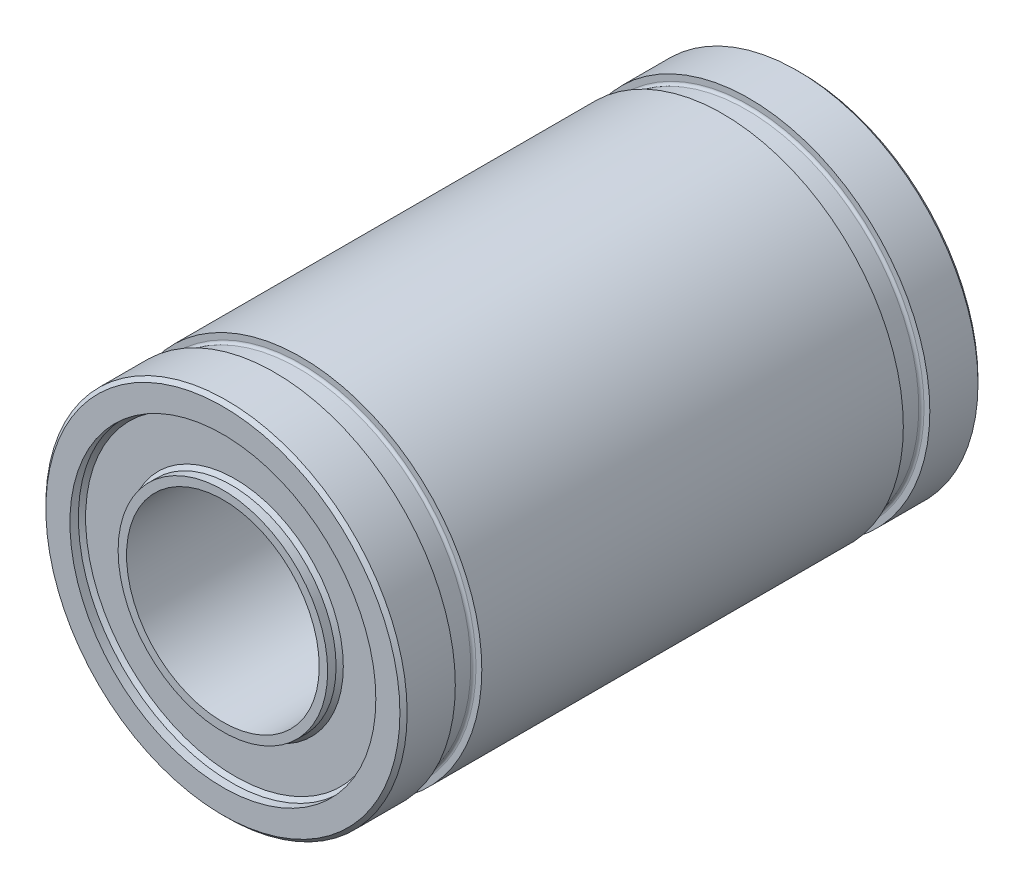
ISO-10303-21;
HEADER;
FILE_DESCRIPTION(('STEP AP214'),'2;1');
FILE_NAME('part.step','',(''),(''),'','','');
FILE_SCHEMA(('AUTOMOTIVE_DESIGN { 1 0 10303 214 1 1 1 1 }'));
ENDSEC;
DATA;
#1=APPLICATION_CONTEXT('core data for automotive mechanical design processes');
#2=APPLICATION_PROTOCOL_DEFINITION('international standard','automotive_design',2000,#1);
#3=PRODUCT_CONTEXT('',#1,'mechanical');
#4=PRODUCT('Part','Part','',(#3));
#5=PRODUCT_RELATED_PRODUCT_CATEGORY('part','',(#4));
#6=PRODUCT_DEFINITION_FORMATION('','',#4);
#7=PRODUCT_DEFINITION_CONTEXT('part definition',#1,'design');
#8=PRODUCT_DEFINITION('design','',#6,#7);
#9=PRODUCT_DEFINITION_SHAPE('','',#8);
#10=(LENGTH_UNIT() NAMED_UNIT(*) SI_UNIT(.MILLI.,.METRE.));
#11=(NAMED_UNIT(*) PLANE_ANGLE_UNIT() SI_UNIT($,.RADIAN.));
#12=(NAMED_UNIT(*) SI_UNIT($,.STERADIAN.) SOLID_ANGLE_UNIT());
#13=UNCERTAINTY_MEASURE_WITH_UNIT(LENGTH_MEASURE(1.E-05),#10,'distance_accuracy_value','');
#14=(GEOMETRIC_REPRESENTATION_CONTEXT(3) GLOBAL_UNCERTAINTY_ASSIGNED_CONTEXT((#13)) GLOBAL_UNIT_ASSIGNED_CONTEXT((#10,
#11,#12)) REPRESENTATION_CONTEXT('',''));
#15=CARTESIAN_POINT('',(0.,0.,0.));
#16=DIRECTION('',(0.,0.,1.));
#17=DIRECTION('',(1.,0.,0.));
#18=AXIS2_PLACEMENT_3D('',#15,#16,#17);
#19=CARTESIAN_POINT('',(0.,0.,-24.));
#20=DIRECTION('',(0.,0.,1.));
#21=DIRECTION('',(1.,0.,0.));
#22=AXIS2_PLACEMENT_3D('',#19,#20,#21);
#23=CYLINDRICAL_SURFACE('',#22,7.5);
#24=CARTESIAN_POINT('',(0.,0.,-23.85));
#25=DIRECTION('',(0.,0.,1.));
#26=DIRECTION('',(1.,0.,0.));
#27=AXIS2_PLACEMENT_3D('',#24,#25,#26);
#28=CIRCLE('',#27,7.5);
#29=CARTESIAN_POINT('',(7.5,0.,-23.85));
#30=VERTEX_POINT('',#29);
#31=EDGE_CURVE('E49',#30,#30,#28,.T.);
#32=ORIENTED_EDGE('',*,*,#31,.T.);
#33=EDGE_LOOP('',(#32));
#34=FACE_BOUND('',#33,.T.);
#35=CARTESIAN_POINT('',(0.,0.,-21.85));
#36=DIRECTION('',(0.,0.,1.));
#37=DIRECTION('',(1.,0.,0.));
#38=AXIS2_PLACEMENT_3D('',#35,#36,#37);
#39=CIRCLE('',#38,7.5);
#40=CARTESIAN_POINT('',(7.5,0.,-21.85));
#41=VERTEX_POINT('',#40);
#42=EDGE_CURVE('E114',#41,#41,#39,.T.);
#43=ORIENTED_EDGE('',*,*,#42,.F.);
#44=EDGE_LOOP('',(#43));
#45=FACE_BOUND('',#44,.T.);
#46=ADVANCED_FACE('F34',(#34,#45),#23,.T.);
#47=CARTESIAN_POINT('',(0.,0.,-3.25));
#48=DIRECTION('',(0.,0.,1.));
#49=DIRECTION('',(1.,0.,0.));
#50=AXIS2_PLACEMENT_3D('',#47,#48,#49);
#51=CIRCLE('',#50,7.5);
#52=CARTESIAN_POINT('',(7.49999999999999,0.,-3.25));
#53=VERTEX_POINT('',#52);
#54=EDGE_CURVE('E96',#53,#53,#51,.T.);
#55=ORIENTED_EDGE('',*,*,#54,.F.);
#56=EDGE_LOOP('',(#55));
#57=FACE_BOUND('',#56,.T.);
#58=CARTESIAN_POINT('',(0.,0.,-20.75));
#59=DIRECTION('',(0.,0.,1.));
#60=DIRECTION('',(1.,0.,0.));
#61=AXIS2_PLACEMENT_3D('',#58,#59,#60);
#62=CIRCLE('',#61,7.5);
#63=CARTESIAN_POINT('',(7.5,0.,-20.75));
#64=VERTEX_POINT('',#63);
#65=EDGE_CURVE('E129',#64,#64,#62,.T.);
#66=ORIENTED_EDGE('',*,*,#65,.T.);
#67=EDGE_LOOP('',(#66));
#68=FACE_BOUND('',#67,.T.);
#69=ADVANCED_FACE('F133',(#57,#68),#23,.T.);
#70=CARTESIAN_POINT('',(0.,0.,-0.150000000000001));
#71=DIRECTION('',(0.,0.,1.));
#72=DIRECTION('',(1.,0.,0.));
#73=AXIS2_PLACEMENT_3D('',#70,#71,#72);
#74=CIRCLE('',#73,7.5);
#75=CARTESIAN_POINT('',(7.5,0.,-0.150000000000001));
#76=VERTEX_POINT('',#75);
#77=EDGE_CURVE('E10',#76,#76,#74,.F.);
#78=ORIENTED_EDGE('',*,*,#77,.T.);
#79=EDGE_LOOP('',(#78));
#80=FACE_BOUND('',#79,.T.);
#81=CARTESIAN_POINT('',(0.,0.,-2.15000000000001));
#82=DIRECTION('',(0.,0.,1.));
#83=DIRECTION('',(1.,0.,0.));
#84=AXIS2_PLACEMENT_3D('',#81,#82,#83);
#85=CIRCLE('',#84,7.5);
#86=CARTESIAN_POINT('',(7.49999999999999,0.,-2.15000000000001));
#87=VERTEX_POINT('',#86);
#88=EDGE_CURVE('E111',#87,#87,#85,.T.);
#89=ORIENTED_EDGE('',*,*,#88,.T.);
#90=EDGE_LOOP('',(#89));
#91=FACE_BOUND('',#90,.T.);
#92=ADVANCED_FACE('F154',(#80,#91),#23,.T.);
#93=CARTESIAN_POINT('',(0.,0.,-24.));
#94=DIRECTION('',(0.,0.,1.));
#95=DIRECTION('',(1.,0.,0.));
#96=AXIS2_PLACEMENT_3D('',#93,#94,#95);
#97=PLANE('',#96);
#98=CARTESIAN_POINT('',(0.,0.,-24.));
#99=DIRECTION('',(0.,0.,1.));
#100=DIRECTION('',(1.,0.,0.));
#101=AXIS2_PLACEMENT_3D('',#98,#99,#100);
#102=CIRCLE('',#101,4.);
#103=CARTESIAN_POINT('',(4.,0.,-24.));
#104=VERTEX_POINT('',#103);
#105=EDGE_CURVE('E78',#104,#104,#102,.T.);
#106=ORIENTED_EDGE('',*,*,#105,.T.);
#107=EDGE_LOOP('',(#106));
#108=FACE_BOUND('',#107,.T.);
#109=CARTESIAN_POINT('',(0.,0.,-24.));
#110=DIRECTION('',(0.,0.,-1.));
#111=DIRECTION('',(-1.,0.,0.));
#112=AXIS2_PLACEMENT_3D('',#109,#110,#111);
#113=CIRCLE('',#112,4.35);
#114=CARTESIAN_POINT('',(-4.35,0.,-24.));
#115=VERTEX_POINT('',#114);
#116=EDGE_CURVE('E93',#115,#115,#113,.T.);
#117=ORIENTED_EDGE('',*,*,#116,.T.);
#118=EDGE_LOOP('',(#117));
#119=FACE_BOUND('',#118,.T.);
#120=ADVANCED_FACE('F162',(#108,#119),#97,.F.);
#121=CARTESIAN_POINT('',(0.,0.,0.));
#122=DIRECTION('',(0.,0.,1.));
#123=DIRECTION('',(1.,0.,0.));
#124=AXIS2_PLACEMENT_3D('',#121,#122,#123);
#125=PLANE('',#124);
#126=CARTESIAN_POINT('',(0.,0.,0.));
#127=DIRECTION('',(0.,0.,1.));
#128=DIRECTION('',(1.,0.,0.));
#129=AXIS2_PLACEMENT_3D('',#126,#127,#128);
#130=CIRCLE('',#129,4.);
#131=CARTESIAN_POINT('',(4.,0.,0.));
#132=VERTEX_POINT('',#131);
#133=EDGE_CURVE('E79',#132,#132,#130,.T.);
#134=ORIENTED_EDGE('',*,*,#133,.F.);
#135=EDGE_LOOP('',(#134));
#136=FACE_BOUND('',#135,.T.);
#137=CARTESIAN_POINT('',(0.,0.,0.));
#138=DIRECTION('',(0.,0.,1.));
#139=DIRECTION('',(1.,0.,0.));
#140=AXIS2_PLACEMENT_3D('',#137,#138,#139);
#141=CIRCLE('',#140,4.35);
#142=CARTESIAN_POINT('',(4.35,0.,0.));
#143=VERTEX_POINT('',#142);
#144=EDGE_CURVE('E87',#143,#143,#141,.T.);
#145=ORIENTED_EDGE('',*,*,#144,.T.);
#146=EDGE_LOOP('',(#145));
#147=FACE_BOUND('',#146,.T.);
#148=ADVANCED_FACE('F166',(#136,#147),#125,.T.);
#149=CARTESIAN_POINT('',(0.,0.,-24.));
#150=DIRECTION('',(0.,0.,1.));
#151=DIRECTION('',(1.,0.,0.));
#152=AXIS2_PLACEMENT_3D('',#149,#150,#151);
#153=CIRCLE('',#152,7.34999999999999);
#154=CARTESIAN_POINT('',(7.34999999999999,0.,-24.));
#155=VERTEX_POINT('',#154);
#156=EDGE_CURVE('E45',#155,#155,#153,.F.);
#157=ORIENTED_EDGE('',*,*,#156,.T.);
#158=EDGE_LOOP('',(#157));
#159=FACE_BOUND('',#158,.T.);
#160=CARTESIAN_POINT('',(0.,0.,-24.));
#161=DIRECTION('',(0.,0.,-1.));
#162=DIRECTION('',(-1.,0.,0.));
#163=AXIS2_PLACEMENT_3D('',#160,#161,#162);
#164=CIRCLE('',#163,6.35);
#165=CARTESIAN_POINT('',(-6.35,0.,-24.));
#166=VERTEX_POINT('',#165);
#167=EDGE_CURVE('E90',#166,#166,#164,.T.);
#168=ORIENTED_EDGE('',*,*,#167,.F.);
#169=EDGE_LOOP('',(#168));
#170=FACE_BOUND('',#169,.T.);
#171=ADVANCED_FACE('F169',(#159,#170),#97,.F.);
#172=CARTESIAN_POINT('',(0.,0.,0.));
#173=DIRECTION('',(0.,0.,1.));
#174=DIRECTION('',(1.,0.,0.));
#175=AXIS2_PLACEMENT_3D('',#172,#173,#174);
#176=CIRCLE('',#175,7.35);
#177=CARTESIAN_POINT('',(7.35,0.,0.));
#178=VERTEX_POINT('',#177);
#179=EDGE_CURVE('E41',#178,#178,#176,.T.);
#180=ORIENTED_EDGE('',*,*,#179,.T.);
#181=EDGE_LOOP('',(#180));
#182=FACE_BOUND('',#181,.T.);
#183=CARTESIAN_POINT('',(0.,0.,0.));
#184=DIRECTION('',(0.,0.,1.));
#185=DIRECTION('',(1.,0.,0.));
#186=AXIS2_PLACEMENT_3D('',#183,#184,#185);
#187=CIRCLE('',#186,6.35);
#188=CARTESIAN_POINT('',(6.35,0.,0.));
#189=VERTEX_POINT('',#188);
#190=EDGE_CURVE('E82',#189,#189,#187,.T.);
#191=ORIENTED_EDGE('',*,*,#190,.F.);
#192=EDGE_LOOP('',(#191));
#193=FACE_BOUND('',#192,.T.);
#194=ADVANCED_FACE('F228',(#182,#193),#125,.T.);
#195=CARTESIAN_POINT('',(0.,0.,-24.));
#196=DIRECTION('',(0.,0.,1.));
#197=DIRECTION('',(1.,0.,0.));
#198=AXIS2_PLACEMENT_3D('',#195,#196,#197);
#199=CYLINDRICAL_SURFACE('',#198,4.);
#200=ORIENTED_EDGE('',*,*,#105,.F.);
#201=EDGE_LOOP('',(#200));
#202=FACE_BOUND('',#201,.T.);
#203=ORIENTED_EDGE('',*,*,#133,.T.);
#204=EDGE_LOOP('',(#203));
#205=FACE_BOUND('',#204,.T.);
#206=ADVANCED_FACE('F225',(#202,#205),#199,.F.);
#207=CARTESIAN_POINT('',(0.,0.,-0.5));
#208=DIRECTION('',(0.,0.,1.));
#209=DIRECTION('',(1.,0.,0.));
#210=AXIS2_PLACEMENT_3D('',#207,#208,#209);
#211=CYLINDRICAL_SURFACE('',#210,6.35);
#212=CARTESIAN_POINT('',(0.,0.,-0.350000000000004));
#213=DIRECTION('',(0.,0.,1.));
#214=DIRECTION('',(1.,0.,0.));
#215=AXIS2_PLACEMENT_3D('',#212,#213,#214);
#216=CIRCLE('',#215,6.35);
#217=CARTESIAN_POINT('',(6.35,0.,-0.350000000000004));
#218=VERTEX_POINT('',#217);
#219=EDGE_CURVE('E57',#218,#218,#216,.F.);
#220=ORIENTED_EDGE('',*,*,#219,.T.);
#221=EDGE_LOOP('',(#220));
#222=FACE_BOUND('',#221,.T.);
#223=ORIENTED_EDGE('',*,*,#190,.T.);
#224=EDGE_LOOP('',(#223));
#225=FACE_BOUND('',#224,.T.);
#226=ADVANCED_FACE('F221',(#222,#225),#211,.F.);
#227=CARTESIAN_POINT('',(0.,0.,-0.5));
#228=DIRECTION('',(0.,0.,1.));
#229=DIRECTION('',(1.,0.,0.));
#230=AXIS2_PLACEMENT_3D('',#227,#228,#229);
#231=PLANE('',#230);
#232=CARTESIAN_POINT('',(0.,0.,-0.5));
#233=DIRECTION('',(0.,0.,1.));
#234=DIRECTION('',(1.,0.,0.));
#235=AXIS2_PLACEMENT_3D('',#232,#233,#234);
#236=CIRCLE('',#235,6.2);
#237=CARTESIAN_POINT('',(6.2,0.,-0.5));
#238=VERTEX_POINT('',#237);
#239=EDGE_CURVE('E60',#238,#238,#236,.T.);
#240=ORIENTED_EDGE('',*,*,#239,.T.);
#241=EDGE_LOOP('',(#240));
#242=FACE_BOUND('',#241,.T.);
#243=CARTESIAN_POINT('',(0.,0.,-0.5));
#244=DIRECTION('',(0.,0.,1.));
#245=DIRECTION('',(1.,0.,0.));
#246=AXIS2_PLACEMENT_3D('',#243,#244,#245);
#247=CIRCLE('',#246,4.5);
#248=CARTESIAN_POINT('',(4.5,0.,-0.5));
#249=VERTEX_POINT('',#248);
#250=EDGE_CURVE('E63',#249,#249,#247,.F.);
#251=ORIENTED_EDGE('',*,*,#250,.T.);
#252=EDGE_LOOP('',(#251));
#253=FACE_BOUND('',#252,.T.);
#254=ADVANCED_FACE('F217',(#242,#253),#231,.T.);
#255=CARTESIAN_POINT('',(0.,0.,-0.5));
#256=DIRECTION('',(0.,0.,1.));
#257=DIRECTION('',(1.,0.,0.));
#258=AXIS2_PLACEMENT_3D('',#255,#256,#257);
#259=CYLINDRICAL_SURFACE('',#258,4.35);
#260=CARTESIAN_POINT('',(0.,0.,-0.349999999999997));
#261=DIRECTION('',(0.,0.,1.));
#262=DIRECTION('',(1.,0.,0.));
#263=AXIS2_PLACEMENT_3D('',#260,#261,#262);
#264=CIRCLE('',#263,4.35);
#265=CARTESIAN_POINT('',(4.35,0.,-0.349999999999997));
#266=VERTEX_POINT('',#265);
#267=EDGE_CURVE('E54',#266,#266,#264,.T.);
#268=ORIENTED_EDGE('',*,*,#267,.T.);
#269=EDGE_LOOP('',(#268));
#270=FACE_BOUND('',#269,.T.);
#271=ORIENTED_EDGE('',*,*,#144,.F.);
#272=EDGE_LOOP('',(#271));
#273=FACE_BOUND('',#272,.T.);
#274=ADVANCED_FACE('F213',(#270,#273),#259,.T.);
#275=CARTESIAN_POINT('',(0.,0.,-23.5));
#276=DIRECTION('',(0.,0.,-1.));
#277=DIRECTION('',(-1.,0.,0.));
#278=AXIS2_PLACEMENT_3D('',#275,#276,#277);
#279=CYLINDRICAL_SURFACE('',#278,6.35);
#280=CARTESIAN_POINT('',(0.,0.,-23.65));
#281=DIRECTION('',(0.,0.,-1.));
#282=DIRECTION('',(-1.,0.,0.));
#283=AXIS2_PLACEMENT_3D('',#280,#281,#282);
#284=CIRCLE('',#283,6.35);
#285=CARTESIAN_POINT('',(-6.35,0.,-23.65));
#286=VERTEX_POINT('',#285);
#287=EDGE_CURVE('E69',#286,#286,#284,.F.);
#288=ORIENTED_EDGE('',*,*,#287,.T.);
#289=EDGE_LOOP('',(#288));
#290=FACE_BOUND('',#289,.T.);
#291=ORIENTED_EDGE('',*,*,#167,.T.);
#292=EDGE_LOOP('',(#291));
#293=FACE_BOUND('',#292,.T.);
#294=ADVANCED_FACE('F209',(#290,#293),#279,.F.);
#295=CARTESIAN_POINT('',(0.,0.,-23.5));
#296=DIRECTION('',(0.,0.,-1.));
#297=DIRECTION('',(-1.,0.,0.));
#298=AXIS2_PLACEMENT_3D('',#295,#296,#297);
#299=PLANE('',#298);
#300=CARTESIAN_POINT('',(0.,0.,-23.5));
#301=DIRECTION('',(0.,0.,-1.));
#302=DIRECTION('',(-1.,0.,0.));
#303=AXIS2_PLACEMENT_3D('',#300,#301,#302);
#304=CIRCLE('',#303,6.2);
#305=CARTESIAN_POINT('',(-6.2,0.,-23.5));
#306=VERTEX_POINT('',#305);
#307=EDGE_CURVE('E72',#306,#306,#304,.T.);
#308=ORIENTED_EDGE('',*,*,#307,.T.);
#309=EDGE_LOOP('',(#308));
#310=FACE_BOUND('',#309,.T.);
#311=CARTESIAN_POINT('',(0.,0.,-23.5));
#312=DIRECTION('',(0.,0.,-1.));
#313=DIRECTION('',(-1.,0.,0.));
#314=AXIS2_PLACEMENT_3D('',#311,#312,#313);
#315=CIRCLE('',#314,4.5);
#316=CARTESIAN_POINT('',(-4.5,0.,-23.5));
#317=VERTEX_POINT('',#316);
#318=EDGE_CURVE('E75',#317,#317,#315,.F.);
#319=ORIENTED_EDGE('',*,*,#318,.T.);
#320=EDGE_LOOP('',(#319));
#321=FACE_BOUND('',#320,.T.);
#322=ADVANCED_FACE('F205',(#310,#321),#299,.T.);
#323=CARTESIAN_POINT('',(0.,0.,-23.5));
#324=DIRECTION('',(0.,0.,-1.));
#325=DIRECTION('',(-1.,0.,0.));
#326=AXIS2_PLACEMENT_3D('',#323,#324,#325);
#327=CYLINDRICAL_SURFACE('',#326,4.35);
#328=CARTESIAN_POINT('',(0.,0.,-23.65));
#329=DIRECTION('',(0.,0.,-1.));
#330=DIRECTION('',(-1.,0.,0.));
#331=AXIS2_PLACEMENT_3D('',#328,#329,#330);
#332=CIRCLE('',#331,4.35);
#333=CARTESIAN_POINT('',(-4.35,0.,-23.65));
#334=VERTEX_POINT('',#333);
#335=EDGE_CURVE('E66',#334,#334,#332,.T.);
#336=ORIENTED_EDGE('',*,*,#335,.T.);
#337=EDGE_LOOP('',(#336));
#338=FACE_BOUND('',#337,.T.);
#339=ORIENTED_EDGE('',*,*,#116,.F.);
#340=EDGE_LOOP('',(#339));
#341=FACE_BOUND('',#340,.T.);
#342=ADVANCED_FACE('F201',(#338,#341),#327,.T.);
#343=CARTESIAN_POINT('',(-6.97821124051748,-2.00303966079445,-3.25));
#344=DIRECTION('',(0.,0.,1.));
#345=DIRECTION('',(1.,0.,0.));
#346=AXIS2_PLACEMENT_3D('',#343,#344,#345);
#347=PLANE('',#346);
#348=ORIENTED_EDGE('',*,*,#54,.T.);
#349=EDGE_LOOP('',(#348));
#350=FACE_BOUND('',#349,.T.);
#351=CARTESIAN_POINT('',(0.,0.,-3.25));
#352=DIRECTION('',(0.,0.,1.));
#353=DIRECTION('',(1.,0.,0.));
#354=AXIS2_PLACEMENT_3D('',#351,#352,#353);
#355=CIRCLE('',#354,7.26);
#356=CARTESIAN_POINT('',(7.26,0.,-3.25));
#357=VERTEX_POINT('',#356);
#358=EDGE_CURVE('E99',#357,#357,#355,.T.);
#359=ORIENTED_EDGE('',*,*,#358,.F.);
#360=EDGE_LOOP('',(#359));
#361=FACE_BOUND('',#360,.T.);
#362=ADVANCED_FACE('F197',(#350,#361),#347,.T.);
#363=CARTESIAN_POINT('',(0.,0.,-3.14));
#364=DIRECTION('',(0.,0.,1.));
#365=DIRECTION('',(1.,0.,0.));
#366=AXIS2_PLACEMENT_3D('',#363,#364,#365);
#367=TOROIDAL_SURFACE('',#366,7.26,0.110000000000001);
#368=ORIENTED_EDGE('',*,*,#358,.T.);
#369=EDGE_LOOP('',(#368));
#370=FACE_BOUND('',#369,.T.);
#371=CARTESIAN_POINT('',(0.,0.,-3.14000000000001));
#372=DIRECTION('',(0.,0.,1.));
#373=DIRECTION('',(1.,0.,0.));
#374=AXIS2_PLACEMENT_3D('',#371,#372,#373);
#375=CIRCLE('',#374,7.15);
#376=CARTESIAN_POINT('',(7.15,0.,-3.14000000000001));
#377=VERTEX_POINT('',#376);
#378=EDGE_CURVE('E102',#377,#377,#375,.T.);
#379=ORIENTED_EDGE('',*,*,#378,.F.);
#380=EDGE_LOOP('',(#379));
#381=FACE_BOUND('',#380,.T.);
#382=ADVANCED_FACE('F193',(#370,#381),#367,.F.);
#383=CARTESIAN_POINT('',(0.,0.,-38.0258731229228));
#384=DIRECTION('',(0.,0.,1.));
#385=DIRECTION('',(1.,0.,0.));
#386=AXIS2_PLACEMENT_3D('',#383,#384,#385);
#387=CYLINDRICAL_SURFACE('',#386,7.15);
#388=ORIENTED_EDGE('',*,*,#378,.T.);
#389=EDGE_LOOP('',(#388));
#390=FACE_BOUND('',#389,.T.);
#391=CARTESIAN_POINT('',(0.,0.,-2.26000000000001));
#392=DIRECTION('',(0.,0.,1.));
#393=DIRECTION('',(1.,0.,0.));
#394=AXIS2_PLACEMENT_3D('',#391,#392,#393);
#395=CIRCLE('',#394,7.15);
#396=CARTESIAN_POINT('',(7.15,0.,-2.26));
#397=VERTEX_POINT('',#396);
#398=EDGE_CURVE('E105',#397,#397,#395,.T.);
#399=ORIENTED_EDGE('',*,*,#398,.F.);
#400=EDGE_LOOP('',(#399));
#401=FACE_BOUND('',#400,.T.);
#402=ADVANCED_FACE('F186',(#390,#401),#387,.T.);
#403=CARTESIAN_POINT('',(0.,0.,-2.26000000000001));
#404=DIRECTION('',(0.,0.,1.));
#405=DIRECTION('',(1.,0.,0.));
#406=AXIS2_PLACEMENT_3D('',#403,#404,#405);
#407=TOROIDAL_SURFACE('',#406,7.26,0.109999999999998);
#408=ORIENTED_EDGE('',*,*,#398,.T.);
#409=EDGE_LOOP('',(#408));
#410=FACE_BOUND('',#409,.T.);
#411=CARTESIAN_POINT('',(0.,0.,-2.15000000000001));
#412=DIRECTION('',(0.,0.,1.));
#413=DIRECTION('',(1.,0.,0.));
#414=AXIS2_PLACEMENT_3D('',#411,#412,#413);
#415=CIRCLE('',#414,7.26);
#416=CARTESIAN_POINT('',(7.26,0.,-2.15000000000001));
#417=VERTEX_POINT('',#416);
#418=EDGE_CURVE('E108',#417,#417,#415,.T.);
#419=ORIENTED_EDGE('',*,*,#418,.F.);
#420=EDGE_LOOP('',(#419));
#421=FACE_BOUND('',#420,.T.);
#422=ADVANCED_FACE('F176',(#410,#421),#407,.F.);
#423=CARTESIAN_POINT('',(-7.20889590962549,-2.06925584792816,-2.15000000000001));
#424=DIRECTION('',(0.,0.,-1.));
#425=DIRECTION('',(-1.,0.,0.));
#426=AXIS2_PLACEMENT_3D('',#423,#424,#425);
#427=PLANE('',#426);
#428=ORIENTED_EDGE('',*,*,#418,.T.);
#429=EDGE_LOOP('',(#428));
#430=FACE_BOUND('',#429,.T.);
#431=ORIENTED_EDGE('',*,*,#88,.F.);
#432=EDGE_LOOP('',(#431));
#433=FACE_BOUND('',#432,.T.);
#434=ADVANCED_FACE('F173',(#430,#433),#427,.T.);
#435=CARTESIAN_POINT('',(-6.97821124051748,-2.00303966079445,-21.85));
#436=DIRECTION('',(0.,0.,1.));
#437=DIRECTION('',(1.,0.,0.));
#438=AXIS2_PLACEMENT_3D('',#435,#436,#437);
#439=PLANE('',#438);
#440=ORIENTED_EDGE('',*,*,#42,.T.);
#441=EDGE_LOOP('',(#440));
#442=FACE_BOUND('',#441,.T.);
#443=CARTESIAN_POINT('',(0.,0.,-21.85));
#444=DIRECTION('',(0.,0.,1.));
#445=DIRECTION('',(1.,0.,0.));
#446=AXIS2_PLACEMENT_3D('',#443,#444,#445);
#447=CIRCLE('',#446,7.26);
#448=CARTESIAN_POINT('',(7.26,0.,-21.85));
#449=VERTEX_POINT('',#448);
#450=EDGE_CURVE('E117',#449,#449,#447,.T.);
#451=ORIENTED_EDGE('',*,*,#450,.F.);
#452=EDGE_LOOP('',(#451));
#453=FACE_BOUND('',#452,.T.);
#454=ADVANCED_FACE('F175',(#442,#453),#439,.T.);
#455=CARTESIAN_POINT('',(0.,0.,-21.74));
#456=DIRECTION('',(0.,0.,1.));
#457=DIRECTION('',(1.,0.,0.));
#458=AXIS2_PLACEMENT_3D('',#455,#456,#457);
#459=TOROIDAL_SURFACE('',#458,7.26,0.110000000000001);
#460=ORIENTED_EDGE('',*,*,#450,.T.);
#461=EDGE_LOOP('',(#460));
#462=FACE_BOUND('',#461,.T.);
#463=CARTESIAN_POINT('',(0.,0.,-21.74));
#464=DIRECTION('',(0.,0.,1.));
#465=DIRECTION('',(1.,0.,0.));
#466=AXIS2_PLACEMENT_3D('',#463,#464,#465);
#467=CIRCLE('',#466,7.15);
#468=CARTESIAN_POINT('',(7.15,0.,-21.74));
#469=VERTEX_POINT('',#468);
#470=EDGE_CURVE('E120',#469,#469,#467,.T.);
#471=ORIENTED_EDGE('',*,*,#470,.F.);
#472=EDGE_LOOP('',(#471));
#473=FACE_BOUND('',#472,.T.);
#474=ADVANCED_FACE('F183',(#462,#473),#459,.F.);
#475=CARTESIAN_POINT('',(0.,0.,-38.0258731229228));
#476=DIRECTION('',(0.,0.,1.));
#477=DIRECTION('',(1.,0.,0.));
#478=AXIS2_PLACEMENT_3D('',#475,#476,#477);
#479=CYLINDRICAL_SURFACE('',#478,7.15);
#480=ORIENTED_EDGE('',*,*,#470,.T.);
#481=EDGE_LOOP('',(#480));
#482=FACE_BOUND('',#481,.T.);
#483=CARTESIAN_POINT('',(0.,0.,-20.86));
#484=DIRECTION('',(0.,0.,1.));
#485=DIRECTION('',(1.,0.,0.));
#486=AXIS2_PLACEMENT_3D('',#483,#484,#485);
#487=CIRCLE('',#486,7.15);
#488=CARTESIAN_POINT('',(7.15,0.,-20.86));
#489=VERTEX_POINT('',#488);
#490=EDGE_CURVE('E123',#489,#489,#487,.T.);
#491=ORIENTED_EDGE('',*,*,#490,.F.);
#492=EDGE_LOOP('',(#491));
#493=FACE_BOUND('',#492,.T.);
#494=ADVANCED_FACE('F148',(#482,#493),#479,.T.);
#495=CARTESIAN_POINT('',(0.,0.,-20.86));
#496=DIRECTION('',(0.,0.,1.));
#497=DIRECTION('',(1.,0.,0.));
#498=AXIS2_PLACEMENT_3D('',#495,#496,#497);
#499=TOROIDAL_SURFACE('',#498,7.26,0.109999999999999);
#500=ORIENTED_EDGE('',*,*,#490,.T.);
#501=EDGE_LOOP('',(#500));
#502=FACE_BOUND('',#501,.T.);
#503=CARTESIAN_POINT('',(0.,0.,-20.75));
#504=DIRECTION('',(0.,0.,1.));
#505=DIRECTION('',(1.,0.,0.));
#506=AXIS2_PLACEMENT_3D('',#503,#504,#505);
#507=CIRCLE('',#506,7.26);
#508=CARTESIAN_POINT('',(7.26,0.,-20.75));
#509=VERTEX_POINT('',#508);
#510=EDGE_CURVE('E126',#509,#509,#507,.T.);
#511=ORIENTED_EDGE('',*,*,#510,.F.);
#512=EDGE_LOOP('',(#511));
#513=FACE_BOUND('',#512,.T.);
#514=ADVANCED_FACE('F138',(#502,#513),#499,.F.);
#515=CARTESIAN_POINT('',(-7.20889590962549,-2.06925584792816,-20.75));
#516=DIRECTION('',(0.,0.,-1.));
#517=DIRECTION('',(-1.,0.,0.));
#518=AXIS2_PLACEMENT_3D('',#515,#516,#517);
#519=PLANE('',#518);
#520=ORIENTED_EDGE('',*,*,#510,.T.);
#521=EDGE_LOOP('',(#520));
#522=FACE_BOUND('',#521,.T.);
#523=ORIENTED_EDGE('',*,*,#65,.F.);
#524=EDGE_LOOP('',(#523));
#525=FACE_BOUND('',#524,.T.);
#526=ADVANCED_FACE('F135',(#522,#525),#519,.T.);
#527=CARTESIAN_POINT('',(0.,0.,-23.5));
#528=DIRECTION('',(0.,0.,-1.));
#529=DIRECTION('',(-1.,0.,0.));
#530=AXIS2_PLACEMENT_3D('',#527,#528,#529);
#531=CONICAL_SURFACE('',#530,6.2,0.785398163397451);
#532=ORIENTED_EDGE('',*,*,#287,.F.);
#533=EDGE_LOOP('',(#532));
#534=FACE_BOUND('',#533,.T.);
#535=ORIENTED_EDGE('',*,*,#307,.F.);
#536=EDGE_LOOP('',(#535));
#537=FACE_BOUND('',#536,.T.);
#538=ADVANCED_FACE('F137',(#534,#537),#531,.F.);
#539=CARTESIAN_POINT('',(0.,0.,-23.65));
#540=DIRECTION('',(0.,0.,1.));
#541=DIRECTION('',(1.,0.,0.));
#542=AXIS2_PLACEMENT_3D('',#539,#540,#541);
#543=CONICAL_SURFACE('',#542,4.35,0.785398163397448);
#544=ORIENTED_EDGE('',*,*,#318,.F.);
#545=EDGE_LOOP('',(#544));
#546=FACE_BOUND('',#545,.T.);
#547=ORIENTED_EDGE('',*,*,#335,.F.);
#548=EDGE_LOOP('',(#547));
#549=FACE_BOUND('',#548,.T.);
#550=ADVANCED_FACE('F145',(#546,#549),#543,.T.);
#551=CARTESIAN_POINT('',(0.,0.,-0.5));
#552=DIRECTION('',(0.,0.,1.));
#553=DIRECTION('',(1.,0.,0.));
#554=AXIS2_PLACEMENT_3D('',#551,#552,#553);
#555=CONICAL_SURFACE('',#554,6.2,0.785398163397454);
#556=ORIENTED_EDGE('',*,*,#219,.F.);
#557=EDGE_LOOP('',(#556));
#558=FACE_BOUND('',#557,.T.);
#559=ORIENTED_EDGE('',*,*,#239,.F.);
#560=EDGE_LOOP('',(#559));
#561=FACE_BOUND('',#560,.T.);
#562=ADVANCED_FACE('F312',(#558,#561),#555,.F.);
#563=CARTESIAN_POINT('',(0.,0.,-0.349999999999997));
#564=DIRECTION('',(0.,0.,-1.));
#565=DIRECTION('',(-1.,0.,0.));
#566=AXIS2_PLACEMENT_3D('',#563,#564,#565);
#567=CONICAL_SURFACE('',#566,4.35,0.78539816339744);
#568=ORIENTED_EDGE('',*,*,#250,.F.);
#569=EDGE_LOOP('',(#568));
#570=FACE_BOUND('',#569,.T.);
#571=ORIENTED_EDGE('',*,*,#267,.F.);
#572=EDGE_LOOP('',(#571));
#573=FACE_BOUND('',#572,.T.);
#574=ADVANCED_FACE('F322',(#570,#573),#567,.T.);
#575=CARTESIAN_POINT('',(0.,0.,-23.85));
#576=DIRECTION('',(0.,0.,1.));
#577=DIRECTION('',(1.,0.,0.));
#578=AXIS2_PLACEMENT_3D('',#575,#576,#577);
#579=CONICAL_SURFACE('',#578,7.5,0.785398163397445);
#580=ORIENTED_EDGE('',*,*,#156,.F.);
#581=EDGE_LOOP('',(#580));
#582=FACE_BOUND('',#581,.T.);
#583=ORIENTED_EDGE('',*,*,#31,.F.);
#584=EDGE_LOOP('',(#583));
#585=FACE_BOUND('',#584,.T.);
#586=ADVANCED_FACE('F332',(#582,#585),#579,.T.);
#587=CARTESIAN_POINT('',(0.,0.,0.));
#588=DIRECTION('',(0.,0.,-1.));
#589=DIRECTION('',(-1.,0.,0.));
#590=AXIS2_PLACEMENT_3D('',#587,#588,#589);
#591=CONICAL_SURFACE('',#590,7.35,0.785398163397448);
#592=ORIENTED_EDGE('',*,*,#77,.F.);
#593=EDGE_LOOP('',(#592));
#594=FACE_BOUND('',#593,.T.);
#595=ORIENTED_EDGE('',*,*,#179,.F.);
#596=EDGE_LOOP('',(#595));
#597=FACE_BOUND('',#596,.T.);
#598=ADVANCED_FACE('F36',(#594,#597),#591,.T.);
#599=CLOSED_SHELL('',(#46,#69,#92,#120,#148,#171,#194,#206,#226,#254,#274,#294,#322,#342,#362,
#382,#402,#422,#434,#454,#474,#494,#514,#526,#538,#550,#562,#574,#586,#598));
#600=MANIFOLD_SOLID_BREP('B2',#599);
#601=ADVANCED_BREP_SHAPE_REPRESENTATION('',(#18,#600),#14);
#602=SHAPE_DEFINITION_REPRESENTATION(#9,#601);
ENDSEC;
END-ISO-10303-21;
